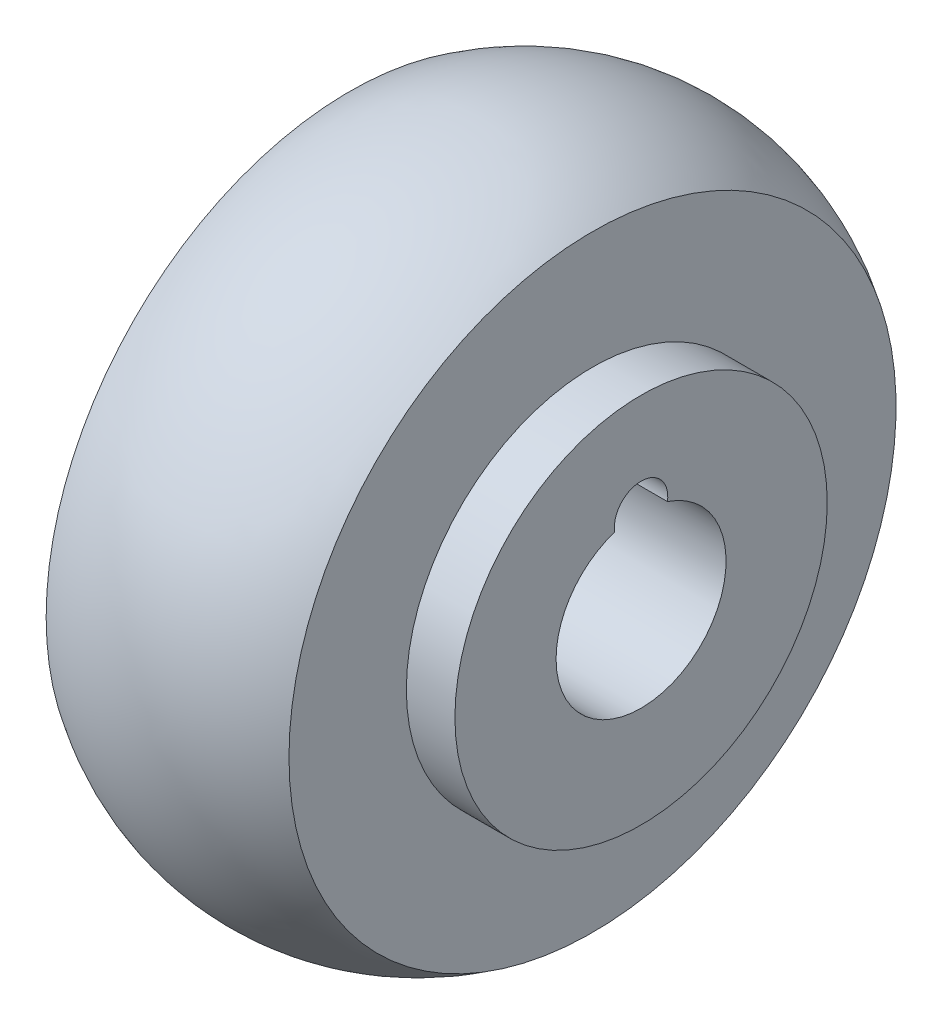
ISO-10303-21;
HEADER;
FILE_DESCRIPTION(('STEP AP214'),'2;1');
FILE_NAME('part.step','',(''),(''),'','','');
FILE_SCHEMA(('AUTOMOTIVE_DESIGN { 1 0 10303 214 1 1 1 1 }'));
ENDSEC;
DATA;
#1=APPLICATION_CONTEXT('core data for automotive mechanical design processes');
#2=APPLICATION_PROTOCOL_DEFINITION('international standard','automotive_design',2000,#1);
#3=PRODUCT_CONTEXT('',#1,'mechanical');
#4=PRODUCT('Part','Part','',(#3));
#5=PRODUCT_RELATED_PRODUCT_CATEGORY('part','',(#4));
#6=PRODUCT_DEFINITION_FORMATION('','',#4);
#7=PRODUCT_DEFINITION_CONTEXT('part definition',#1,'design');
#8=PRODUCT_DEFINITION('design','',#6,#7);
#9=PRODUCT_DEFINITION_SHAPE('','',#8);
#10=(LENGTH_UNIT() NAMED_UNIT(*) SI_UNIT(.MILLI.,.METRE.));
#11=(NAMED_UNIT(*) PLANE_ANGLE_UNIT() SI_UNIT($,.RADIAN.));
#12=(NAMED_UNIT(*) SI_UNIT($,.STERADIAN.) SOLID_ANGLE_UNIT());
#13=UNCERTAINTY_MEASURE_WITH_UNIT(LENGTH_MEASURE(1.E-05),#10,'distance_accuracy_value','');
#14=(GEOMETRIC_REPRESENTATION_CONTEXT(3) GLOBAL_UNCERTAINTY_ASSIGNED_CONTEXT((#13)) GLOBAL_UNIT_ASSIGNED_CONTEXT((#10,
#11,#12)) REPRESENTATION_CONTEXT('',''));
#15=CARTESIAN_POINT('',(0.,0.,0.));
#16=DIRECTION('',(0.,0.,1.));
#17=DIRECTION('',(1.,0.,0.));
#18=AXIS2_PLACEMENT_3D('',#15,#16,#17);
#19=CARTESIAN_POINT('',(21.,0.,-10.5));
#20=DIRECTION('',(-1.,0.,0.));
#21=DIRECTION('',(0.,0.,1.));
#22=AXIS2_PLACEMENT_3D('',#19,#20,#21);
#23=PLANE('',#22);
#24=CARTESIAN_POINT('',(21.,0.,0.));
#25=DIRECTION('',(-1.,0.,0.));
#26=DIRECTION('',(0.,0.,1.));
#27=AXIS2_PLACEMENT_3D('',#24,#25,#26);
#28=CIRCLE('',#27,23.);
#29=CARTESIAN_POINT('',(21.,0.,23.));
#30=VERTEX_POINT('',#29);
#31=EDGE_CURVE('E107',#30,#30,#28,.T.);
#32=ORIENTED_EDGE('',*,*,#31,.F.);
#33=EDGE_LOOP('',(#32));
#34=FACE_BOUND('',#33,.T.);
#35=CARTESIAN_POINT('',(21.,10.5,0.));
#36=DIRECTION('',(1.,0.,0.));
#37=DIRECTION('',(0.,0.,-1.));
#38=AXIS2_PLACEMENT_3D('',#35,#36,#37);
#39=CIRCLE('',#38,3.3);
#40=CARTESIAN_POINT('',(21.,9.98142857142857,-3.25900041016711));
#41=VERTEX_POINT('',#40);
#42=CARTESIAN_POINT('',(21.,9.98142857142857,3.25900041016711));
#43=VERTEX_POINT('',#42);
#44=EDGE_CURVE('E59',#41,#43,#39,.T.);
#45=ORIENTED_EDGE('',*,*,#44,.F.);
#46=CARTESIAN_POINT('',(21.,0.,0.));
#47=DIRECTION('',(-1.,0.,0.));
#48=DIRECTION('',(0.,0.,1.));
#49=AXIS2_PLACEMENT_3D('',#46,#47,#48);
#50=CIRCLE('',#49,10.5);
#51=EDGE_CURVE('E111',#41,#43,#50,.T.);
#52=ORIENTED_EDGE('',*,*,#51,.T.);
#53=EDGE_LOOP('',(#45,#52));
#54=FACE_BOUND('',#53,.T.);
#55=ADVANCED_FACE('F43',(#34,#54),#23,.F.);
#56=CARTESIAN_POINT('',(-21.,0.,-10.5));
#57=DIRECTION('',(1.,0.,0.));
#58=DIRECTION('',(0.,0.,-1.));
#59=AXIS2_PLACEMENT_3D('',#56,#57,#58);
#60=PLANE('',#59);
#61=CARTESIAN_POINT('',(-21.,0.,0.));
#62=DIRECTION('',(-1.,0.,0.));
#63=DIRECTION('',(0.,0.,1.));
#64=AXIS2_PLACEMENT_3D('',#61,#62,#63);
#65=CIRCLE('',#64,10.5);
#66=CARTESIAN_POINT('',(-21.,0.,10.5));
#67=VERTEX_POINT('',#66);
#68=EDGE_CURVE('E81',#67,#67,#65,.T.);
#69=ORIENTED_EDGE('',*,*,#68,.F.);
#70=EDGE_LOOP('',(#69));
#71=FACE_BOUND('',#70,.T.);
#72=CARTESIAN_POINT('',(-21.,0.,0.));
#73=DIRECTION('',(-1.,0.,0.));
#74=DIRECTION('',(0.,0.,1.));
#75=AXIS2_PLACEMENT_3D('',#72,#73,#74);
#76=CIRCLE('',#75,23.);
#77=CARTESIAN_POINT('',(-21.,0.,23.));
#78=VERTEX_POINT('',#77);
#79=EDGE_CURVE('E76',#78,#78,#76,.T.);
#80=ORIENTED_EDGE('',*,*,#79,.T.);
#81=EDGE_LOOP('',(#80));
#82=FACE_BOUND('',#81,.T.);
#83=ADVANCED_FACE('F45',(#71,#82),#60,.F.);
#84=CARTESIAN_POINT('',(-68.247922762495,0.,0.));
#85=DIRECTION('',(-1.,0.,0.));
#86=DIRECTION('',(0.,0.,1.));
#87=AXIS2_PLACEMENT_3D('',#84,#85,#86);
#88=CYLINDRICAL_SURFACE('',#87,23.);
#89=ORIENTED_EDGE('',*,*,#79,.F.);
#90=EDGE_LOOP('',(#89));
#91=FACE_BOUND('',#90,.T.);
#92=CARTESIAN_POINT('',(-15.,0.,0.));
#93=DIRECTION('',(-1.,0.,0.));
#94=DIRECTION('',(0.,0.,1.));
#95=AXIS2_PLACEMENT_3D('',#92,#93,#94);
#96=CIRCLE('',#95,23.);
#97=CARTESIAN_POINT('',(-15.,0.,23.));
#98=VERTEX_POINT('',#97);
#99=EDGE_CURVE('E91',#98,#98,#96,.T.);
#100=ORIENTED_EDGE('',*,*,#99,.T.);
#101=EDGE_LOOP('',(#100));
#102=FACE_BOUND('',#101,.T.);
#103=ADVANCED_FACE('F133',(#91,#102),#88,.T.);
#104=CARTESIAN_POINT('',(-15.,0.,-23.));
#105=DIRECTION('',(1.,0.,0.));
#106=DIRECTION('',(0.,0.,-1.));
#107=AXIS2_PLACEMENT_3D('',#104,#105,#106);
#108=PLANE('',#107);
#109=ORIENTED_EDGE('',*,*,#99,.F.);
#110=EDGE_LOOP('',(#109));
#111=FACE_BOUND('',#110,.T.);
#112=CARTESIAN_POINT('',(-15.,0.,0.));
#113=DIRECTION('',(-1.,0.,0.));
#114=DIRECTION('',(0.,0.,1.));
#115=AXIS2_PLACEMENT_3D('',#112,#113,#114);
#116=CIRCLE('',#115,37.5);
#117=CARTESIAN_POINT('',(-15.,0.,37.5));
#118=VERTEX_POINT('',#117);
#119=EDGE_CURVE('E95',#118,#118,#116,.T.);
#120=ORIENTED_EDGE('',*,*,#119,.T.);
#121=EDGE_LOOP('',(#120));
#122=FACE_BOUND('',#121,.T.);
#123=ADVANCED_FACE('F138',(#111,#122),#108,.F.);
#124=CARTESIAN_POINT('',(0.,0.,0.));
#125=DIRECTION('',(-1.,0.,0.));
#126=DIRECTION('',(0.,0.,1.));
#127=AXIS2_PLACEMENT_3D('',#124,#125,#126);
#128=DEGENERATE_TOROIDAL_SURFACE('',#127,14.75,27.25,.T.);
#129=ORIENTED_EDGE('',*,*,#119,.F.);
#130=EDGE_LOOP('',(#129));
#131=FACE_BOUND('',#130,.T.);
#132=CARTESIAN_POINT('',(15.,0.,0.));
#133=DIRECTION('',(-1.,0.,0.));
#134=DIRECTION('',(0.,0.,1.));
#135=AXIS2_PLACEMENT_3D('',#132,#133,#134);
#136=CIRCLE('',#135,37.5);
#137=CARTESIAN_POINT('',(15.,0.,37.5));
#138=VERTEX_POINT('',#137);
#139=EDGE_CURVE('E99',#138,#138,#136,.T.);
#140=ORIENTED_EDGE('',*,*,#139,.T.);
#141=EDGE_LOOP('',(#140));
#142=FACE_BOUND('',#141,.T.);
#143=ADVANCED_FACE('F143',(#131,#142),#128,.T.);
#144=CARTESIAN_POINT('',(15.,0.,-37.5));
#145=DIRECTION('',(-1.,0.,0.));
#146=DIRECTION('',(0.,0.,1.));
#147=AXIS2_PLACEMENT_3D('',#144,#145,#146);
#148=PLANE('',#147);
#149=ORIENTED_EDGE('',*,*,#139,.F.);
#150=EDGE_LOOP('',(#149));
#151=FACE_BOUND('',#150,.T.);
#152=CARTESIAN_POINT('',(15.,0.,0.));
#153=DIRECTION('',(-1.,0.,0.));
#154=DIRECTION('',(0.,0.,1.));
#155=AXIS2_PLACEMENT_3D('',#152,#153,#154);
#156=CIRCLE('',#155,23.);
#157=CARTESIAN_POINT('',(15.,0.,23.));
#158=VERTEX_POINT('',#157);
#159=EDGE_CURVE('E103',#158,#158,#156,.T.);
#160=ORIENTED_EDGE('',*,*,#159,.T.);
#161=EDGE_LOOP('',(#160));
#162=FACE_BOUND('',#161,.T.);
#163=ADVANCED_FACE('F149',(#151,#162),#148,.F.);
#164=CARTESIAN_POINT('',(-68.247922762495,0.,0.));
#165=DIRECTION('',(-1.,0.,0.));
#166=DIRECTION('',(0.,0.,1.));
#167=AXIS2_PLACEMENT_3D('',#164,#165,#166);
#168=CYLINDRICAL_SURFACE('',#167,23.);
#169=ORIENTED_EDGE('',*,*,#159,.F.);
#170=EDGE_LOOP('',(#169));
#171=FACE_BOUND('',#170,.T.);
#172=ORIENTED_EDGE('',*,*,#31,.T.);
#173=EDGE_LOOP('',(#172));
#174=FACE_BOUND('',#173,.T.);
#175=ADVANCED_FACE('F155',(#171,#174),#168,.T.);
#176=CARTESIAN_POINT('',(-68.247922762495,0.,0.));
#177=DIRECTION('',(-1.,0.,0.));
#178=DIRECTION('',(0.,0.,1.));
#179=AXIS2_PLACEMENT_3D('',#176,#177,#178);
#180=CYLINDRICAL_SURFACE('',#179,10.5);
#181=ORIENTED_EDGE('',*,*,#51,.F.);
#182=DIRECTION('',(1.,0.,0.));
#183=VECTOR('',#182,1.);
#184=CARTESIAN_POINT('',(15.,9.98142857142857,-3.25900041016711));
#185=LINE('',#184,#183);
#186=CARTESIAN_POINT('',(9.00000000000001,9.98142857142857,-3.25900041016711));
#187=VERTEX_POINT('',#186);
#188=EDGE_CURVE('E11',#41,#187,#185,.F.);
#189=ORIENTED_EDGE('',*,*,#188,.T.);
#190=CARTESIAN_POINT('',(9.00000000000001,0.,0.));
#191=DIRECTION('',(-1.,0.,0.));
#192=DIRECTION('',(0.,0.,1.));
#193=AXIS2_PLACEMENT_3D('',#190,#191,#192);
#194=CIRCLE('',#193,10.5);
#195=CARTESIAN_POINT('',(9.00000000000001,9.98142857142857,3.25900041016711));
#196=VERTEX_POINT('',#195);
#197=EDGE_CURVE('E52',#187,#196,#194,.F.);
#198=ORIENTED_EDGE('',*,*,#197,.T.);
#199=DIRECTION('',(1.,0.,0.));
#200=VECTOR('',#199,1.);
#201=CARTESIAN_POINT('',(15.,9.98142857142857,3.25900041016711));
#202=LINE('',#201,#200);
#203=EDGE_CURVE('E67',#196,#43,#202,.T.);
#204=ORIENTED_EDGE('',*,*,#203,.T.);
#205=EDGE_LOOP('',(#181,#189,#198,#204));
#206=FACE_BOUND('',#205,.T.);
#207=ORIENTED_EDGE('',*,*,#68,.T.);
#208=EDGE_LOOP('',(#207));
#209=FACE_BOUND('',#208,.T.);
#210=ADVANCED_FACE('F83',(#206,#209),#180,.F.);
#211=CARTESIAN_POINT('',(9.00000000000001,10.5,0.));
#212=DIRECTION('',(-1.,0.,0.));
#213=DIRECTION('',(0.,0.,1.));
#214=AXIS2_PLACEMENT_3D('',#211,#212,#213);
#215=PLANE('',#214);
#216=CARTESIAN_POINT('',(9.00000000000001,10.5,0.));
#217=DIRECTION('',(1.,0.,0.));
#218=DIRECTION('',(0.,0.,-1.));
#219=AXIS2_PLACEMENT_3D('',#216,#217,#218);
#220=CIRCLE('',#219,3.3);
#221=EDGE_CURVE('E70',#187,#196,#220,.T.);
#222=ORIENTED_EDGE('',*,*,#221,.T.);
#223=ORIENTED_EDGE('',*,*,#197,.F.);
#224=EDGE_LOOP('',(#222,#223));
#225=FACE_BOUND('',#224,.T.);
#226=ADVANCED_FACE('F79',(#225),#215,.F.);
#227=CARTESIAN_POINT('',(21.,10.5,0.));
#228=DIRECTION('',(1.,0.,0.));
#229=DIRECTION('',(0.,0.,-1.));
#230=AXIS2_PLACEMENT_3D('',#227,#228,#229);
#231=CYLINDRICAL_SURFACE('',#230,3.3);
#232=ORIENTED_EDGE('',*,*,#44,.T.);
#233=ORIENTED_EDGE('',*,*,#203,.F.);
#234=ORIENTED_EDGE('',*,*,#221,.F.);
#235=ORIENTED_EDGE('',*,*,#188,.F.);
#236=EDGE_LOOP('',(#232,#233,#234,#235));
#237=FACE_BOUND('',#236,.T.);
#238=ADVANCED_FACE('F69',(#237),#231,.F.);
#239=CLOSED_SHELL('',(#55,#83,#103,#123,#143,#163,#175,#210,#226,#238));
#240=MANIFOLD_SOLID_BREP('B2',#239);
#241=ADVANCED_BREP_SHAPE_REPRESENTATION('',(#18,#240),#14);
#242=SHAPE_DEFINITION_REPRESENTATION(#9,#241);
ENDSEC;
END-ISO-10303-21;
